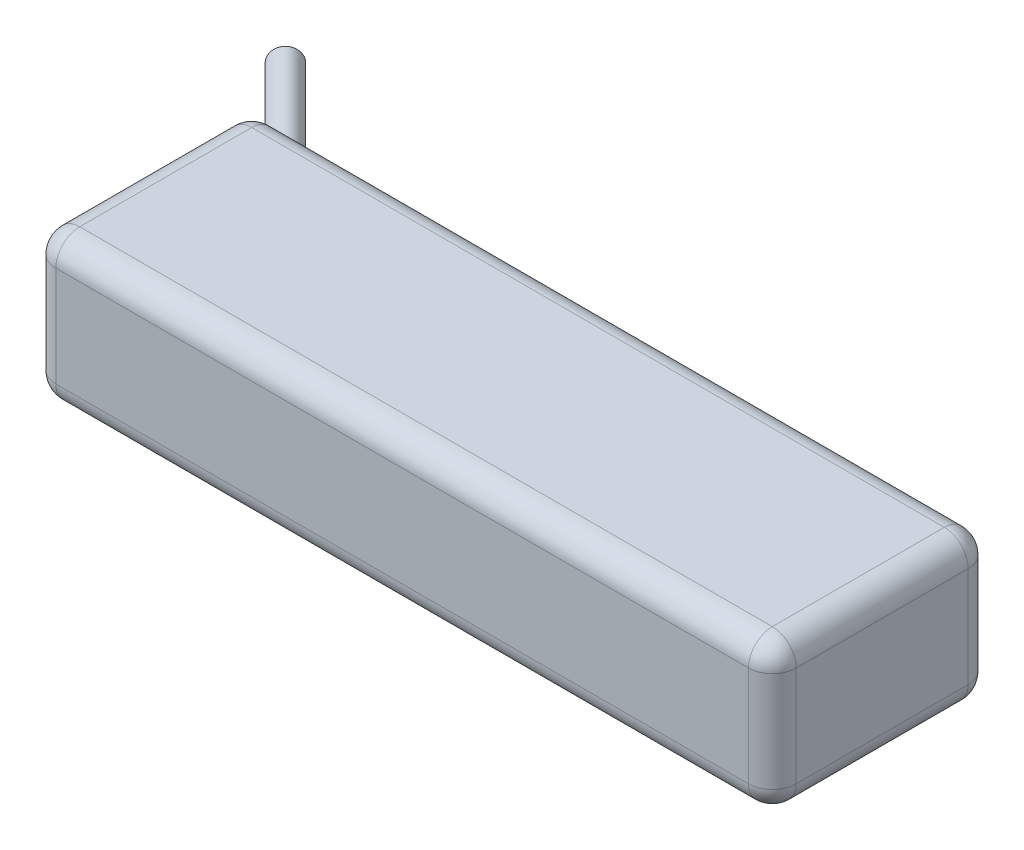
ISO-10303-21;
HEADER;
FILE_DESCRIPTION(('STEP AP214'),'2;1');
FILE_NAME('part.step','',(''),(''),'','','');
FILE_SCHEMA(('AUTOMOTIVE_DESIGN { 1 0 10303 214 1 1 1 1 }'));
ENDSEC;
DATA;
#1=APPLICATION_CONTEXT('core data for automotive mechanical design processes');
#2=APPLICATION_PROTOCOL_DEFINITION('international standard','automotive_design',2000,#1);
#3=PRODUCT_CONTEXT('',#1,'mechanical');
#4=PRODUCT('Part','Part','',(#3));
#5=PRODUCT_RELATED_PRODUCT_CATEGORY('part','',(#4));
#6=PRODUCT_DEFINITION_FORMATION('','',#4);
#7=PRODUCT_DEFINITION_CONTEXT('part definition',#1,'design');
#8=PRODUCT_DEFINITION('design','',#6,#7);
#9=PRODUCT_DEFINITION_SHAPE('','',#8);
#10=(LENGTH_UNIT() NAMED_UNIT(*) SI_UNIT(.MILLI.,.METRE.));
#11=(NAMED_UNIT(*) PLANE_ANGLE_UNIT() SI_UNIT($,.RADIAN.));
#12=(NAMED_UNIT(*) SI_UNIT($,.STERADIAN.) SOLID_ANGLE_UNIT());
#13=UNCERTAINTY_MEASURE_WITH_UNIT(LENGTH_MEASURE(1.E-05),#10,'distance_accuracy_value','');
#14=(GEOMETRIC_REPRESENTATION_CONTEXT(3) GLOBAL_UNCERTAINTY_ASSIGNED_CONTEXT((#13)) GLOBAL_UNIT_ASSIGNED_CONTEXT((#10,
#11,#12)) REPRESENTATION_CONTEXT('',''));
#15=CARTESIAN_POINT('',(0.,0.,0.));
#16=DIRECTION('',(0.,0.,1.));
#17=DIRECTION('',(1.,0.,0.));
#18=AXIS2_PLACEMENT_3D('',#15,#16,#17);
#19=CARTESIAN_POINT('',(77.5,15.5,-23.));
#20=DIRECTION('',(-1.,0.,0.));
#21=DIRECTION('',(0.,0.,1.));
#22=AXIS2_PLACEMENT_3D('',#19,#20,#21);
#23=PLANE('',#22);
#24=DIRECTION('',(0.,-1.,0.));
#25=VECTOR('',#24,1.);
#26=CARTESIAN_POINT('',(77.5,15.5,18.));
#27=LINE('',#26,#25);
#28=CARTESIAN_POINT('',(77.5,10.5,18.));
#29=VERTEX_POINT('',#28);
#30=CARTESIAN_POINT('',(77.5,-10.5,18.));
#31=VERTEX_POINT('',#30);
#32=EDGE_CURVE('E200',#29,#31,#27,.T.);
#33=ORIENTED_EDGE('',*,*,#32,.T.);
#34=DIRECTION('',(0.,0.,-1.));
#35=VECTOR('',#34,1.);
#36=CARTESIAN_POINT('',(77.5,-10.5,-23.));
#37=LINE('',#36,#35);
#38=CARTESIAN_POINT('',(77.5,-10.5,-18.));
#39=VERTEX_POINT('',#38);
#40=EDGE_CURVE('E205',#31,#39,#37,.T.);
#41=ORIENTED_EDGE('',*,*,#40,.T.);
#42=DIRECTION('',(0.,-1.,0.));
#43=VECTOR('',#42,1.);
#44=CARTESIAN_POINT('',(77.5,15.5,-18.));
#45=LINE('',#44,#43);
#46=CARTESIAN_POINT('',(77.5,10.5,-18.));
#47=VERTEX_POINT('',#46);
#48=EDGE_CURVE('E202',#39,#47,#45,.F.);
#49=ORIENTED_EDGE('',*,*,#48,.T.);
#50=DIRECTION('',(0.,0.,-1.));
#51=VECTOR('',#50,1.);
#52=CARTESIAN_POINT('',(77.5,10.5,23.));
#53=LINE('',#52,#51);
#54=EDGE_CURVE('E198',#47,#29,#53,.F.);
#55=ORIENTED_EDGE('',*,*,#54,.T.);
#56=EDGE_LOOP('',(#33,#41,#49,#55));
#57=FACE_BOUND('',#56,.T.);
#58=ADVANCED_FACE('F36',(#57),#23,.F.);
#59=CARTESIAN_POINT('',(-77.5,15.5,-23.));
#60=DIRECTION('',(0.,0.,1.));
#61=DIRECTION('',(1.,0.,0.));
#62=AXIS2_PLACEMENT_3D('',#59,#60,#61);
#63=PLANE('',#62);
#64=CARTESIAN_POINT('',(-70.4289321881345,-6.,-23.));
#65=DIRECTION('',(0.,0.,1.));
#66=DIRECTION('',(1.,0.,0.));
#67=AXIS2_PLACEMENT_3D('',#64,#65,#66);
#68=ELLIPSE('',#67,4.24264068711925,2.99999999999999);
#69=CARTESIAN_POINT('',(-67.4999999999999,-3.82959033391061,-23.));
#70=VERTEX_POINT('',#69);
#71=CARTESIAN_POINT('',(-72.5,-3.38172975815573,-23.));
#72=VERTEX_POINT('',#71);
#73=EDGE_CURVE('E159',#70,#72,#68,.T.);
#74=ORIENTED_EDGE('',*,*,#73,.T.);
#75=DIRECTION('',(0.,-1.,0.));
#76=VECTOR('',#75,1.);
#77=CARTESIAN_POINT('',(-72.5,15.5,-23.));
#78=LINE('',#77,#76);
#79=CARTESIAN_POINT('',(-72.5,3.3817297581557,-23.));
#80=VERTEX_POINT('',#79);
#81=EDGE_CURVE('E196',#72,#80,#78,.F.);
#82=ORIENTED_EDGE('',*,*,#81,.T.);
#83=CARTESIAN_POINT('',(-70.4289321881345,6.,-23.));
#84=DIRECTION('',(0.,0.,1.));
#85=DIRECTION('',(1.,0.,0.));
#86=AXIS2_PLACEMENT_3D('',#83,#84,#85);
#87=ELLIPSE('',#86,4.24264068711927,3.);
#88=CARTESIAN_POINT('',(-67.4999999999999,3.82959033391058,-23.));
#89=VERTEX_POINT('',#88);
#90=EDGE_CURVE('E183',#80,#89,#87,.T.);
#91=ORIENTED_EDGE('',*,*,#90,.T.);
#92=DIRECTION('',(0.,1.,0.));
#93=VECTOR('',#92,1.);
#94=CARTESIAN_POINT('',(-67.4999999999999,15.5,-23.));
#95=LINE('',#94,#93);
#96=CARTESIAN_POINT('',(-67.4999999999999,8.17040966608942,-23.));
#97=VERTEX_POINT('',#96);
#98=EDGE_CURVE('E179',#89,#97,#95,.T.);
#99=ORIENTED_EDGE('',*,*,#98,.T.);
#100=CARTESIAN_POINT('',(-72.5,8.61827024184429,-23.));
#101=VERTEX_POINT('',#100);
#102=EDGE_CURVE('E165',#97,#101,#87,.T.);
#103=ORIENTED_EDGE('',*,*,#102,.T.);
#104=DIRECTION('',(0.,-1.,0.));
#105=VECTOR('',#104,1.);
#106=CARTESIAN_POINT('',(-72.5,15.5,-23.));
#107=LINE('',#106,#105);
#108=CARTESIAN_POINT('',(-72.5,10.5,-23.));
#109=VERTEX_POINT('',#108);
#110=EDGE_CURVE('E188',#101,#109,#107,.F.);
#111=ORIENTED_EDGE('',*,*,#110,.T.);
#112=DIRECTION('',(-1.,0.,0.));
#113=VECTOR('',#112,1.);
#114=CARTESIAN_POINT('',(77.5,10.5,-23.));
#115=LINE('',#114,#113);
#116=CARTESIAN_POINT('',(72.5,10.5,-23.));
#117=VERTEX_POINT('',#116);
#118=EDGE_CURVE('E186',#109,#117,#115,.F.);
#119=ORIENTED_EDGE('',*,*,#118,.T.);
#120=DIRECTION('',(0.,-1.,0.));
#121=VECTOR('',#120,1.);
#122=CARTESIAN_POINT('',(72.5,15.5,-23.));
#123=LINE('',#122,#121);
#124=CARTESIAN_POINT('',(72.5,-10.5,-23.));
#125=VERTEX_POINT('',#124);
#126=EDGE_CURVE('E190',#117,#125,#123,.T.);
#127=ORIENTED_EDGE('',*,*,#126,.T.);
#128=DIRECTION('',(-1.,0.,0.));
#129=VECTOR('',#128,1.);
#130=CARTESIAN_POINT('',(-77.5,-10.5,-23.));
#131=LINE('',#130,#129);
#132=CARTESIAN_POINT('',(-72.5,-10.5,-23.));
#133=VERTEX_POINT('',#132);
#134=EDGE_CURVE('E193',#125,#133,#131,.T.);
#135=ORIENTED_EDGE('',*,*,#134,.T.);
#136=DIRECTION('',(0.,-1.,0.));
#137=VECTOR('',#136,1.);
#138=CARTESIAN_POINT('',(-72.5,15.5,-23.));
#139=LINE('',#138,#137);
#140=CARTESIAN_POINT('',(-72.5,-8.61827024184429,-23.));
#141=VERTEX_POINT('',#140);
#142=EDGE_CURVE('E155',#133,#141,#139,.F.);
#143=ORIENTED_EDGE('',*,*,#142,.T.);
#144=CARTESIAN_POINT('',(-67.4999999999999,-8.1704096660894,-23.));
#145=VERTEX_POINT('',#144);
#146=EDGE_CURVE('E149',#141,#145,#68,.T.);
#147=ORIENTED_EDGE('',*,*,#146,.T.);
#148=DIRECTION('',(0.,1.,0.));
#149=VECTOR('',#148,1.);
#150=CARTESIAN_POINT('',(-67.4999999999999,15.5,-23.));
#151=LINE('',#150,#149);
#152=EDGE_CURVE('E153',#145,#70,#151,.T.);
#153=ORIENTED_EDGE('',*,*,#152,.T.);
#154=EDGE_LOOP('',(#74,#82,#91,#99,#103,#111,#119,#127,#135,#143,#147,#153));
#155=FACE_BOUND('',#154,.T.);
#156=ADVANCED_FACE('F152',(#155),#63,.F.);
#157=CARTESIAN_POINT('',(-77.5,15.5,-23.));
#158=DIRECTION('',(1.,0.,0.));
#159=DIRECTION('',(0.,0.,-1.));
#160=AXIS2_PLACEMENT_3D('',#157,#158,#159);
#161=PLANE('',#160);
#162=DIRECTION('',(0.,-1.,0.));
#163=VECTOR('',#162,1.);
#164=CARTESIAN_POINT('',(-77.5,15.5,-18.));
#165=LINE('',#164,#163);
#166=CARTESIAN_POINT('',(-77.5,10.5,-18.));
#167=VERTEX_POINT('',#166);
#168=CARTESIAN_POINT('',(-77.5,-10.5,-18.));
#169=VERTEX_POINT('',#168);
#170=EDGE_CURVE('E211',#167,#169,#165,.T.);
#171=ORIENTED_EDGE('',*,*,#170,.T.);
#172=DIRECTION('',(0.,0.,1.));
#173=VECTOR('',#172,1.);
#174=CARTESIAN_POINT('',(-77.5,-10.5,-23.));
#175=LINE('',#174,#173);
#176=CARTESIAN_POINT('',(-77.5,-10.5,18.));
#177=VERTEX_POINT('',#176);
#178=EDGE_CURVE('E214',#169,#177,#175,.T.);
#179=ORIENTED_EDGE('',*,*,#178,.T.);
#180=DIRECTION('',(0.,-1.,0.));
#181=VECTOR('',#180,1.);
#182=CARTESIAN_POINT('',(-77.5,15.5,18.));
#183=LINE('',#182,#181);
#184=CARTESIAN_POINT('',(-77.5,10.5,18.));
#185=VERTEX_POINT('',#184);
#186=EDGE_CURVE('E209',#177,#185,#183,.F.);
#187=ORIENTED_EDGE('',*,*,#186,.T.);
#188=DIRECTION('',(0.,0.,1.));
#189=VECTOR('',#188,1.);
#190=CARTESIAN_POINT('',(-77.5,10.5,-23.));
#191=LINE('',#190,#189);
#192=EDGE_CURVE('E207',#185,#167,#191,.F.);
#193=ORIENTED_EDGE('',*,*,#192,.T.);
#194=EDGE_LOOP('',(#171,#179,#187,#193));
#195=FACE_BOUND('',#194,.T.);
#196=ADVANCED_FACE('F284',(#195),#161,.F.);
#197=CARTESIAN_POINT('',(-77.5,15.5,23.));
#198=DIRECTION('',(0.,0.,-1.));
#199=DIRECTION('',(-1.,0.,0.));
#200=AXIS2_PLACEMENT_3D('',#197,#198,#199);
#201=PLANE('',#200);
#202=DIRECTION('',(0.,-1.,0.));
#203=VECTOR('',#202,1.);
#204=CARTESIAN_POINT('',(-72.5,15.5,23.));
#205=LINE('',#204,#203);
#206=CARTESIAN_POINT('',(-72.5,10.5,23.));
#207=VERTEX_POINT('',#206);
#208=CARTESIAN_POINT('',(-72.5,-10.5,23.));
#209=VERTEX_POINT('',#208);
#210=EDGE_CURVE('E220',#207,#209,#205,.T.);
#211=ORIENTED_EDGE('',*,*,#210,.T.);
#212=DIRECTION('',(1.,0.,0.));
#213=VECTOR('',#212,1.);
#214=CARTESIAN_POINT('',(-77.5,-10.5,23.));
#215=LINE('',#214,#213);
#216=CARTESIAN_POINT('',(72.5,-10.5,23.));
#217=VERTEX_POINT('',#216);
#218=EDGE_CURVE('E223',#209,#217,#215,.T.);
#219=ORIENTED_EDGE('',*,*,#218,.T.);
#220=DIRECTION('',(0.,-1.,0.));
#221=VECTOR('',#220,1.);
#222=CARTESIAN_POINT('',(72.5,15.5,23.));
#223=LINE('',#222,#221);
#224=CARTESIAN_POINT('',(72.5,10.5,23.));
#225=VERTEX_POINT('',#224);
#226=EDGE_CURVE('E218',#217,#225,#223,.F.);
#227=ORIENTED_EDGE('',*,*,#226,.T.);
#228=DIRECTION('',(1.,0.,0.));
#229=VECTOR('',#228,1.);
#230=CARTESIAN_POINT('',(-77.5,10.5,23.));
#231=LINE('',#230,#229);
#232=EDGE_CURVE('E216',#225,#207,#231,.F.);
#233=ORIENTED_EDGE('',*,*,#232,.T.);
#234=EDGE_LOOP('',(#211,#219,#227,#233));
#235=FACE_BOUND('',#234,.T.);
#236=ADVANCED_FACE('F278',(#235),#201,.F.);
#237=CARTESIAN_POINT('',(0.,15.5,0.));
#238=DIRECTION('',(0.,1.,0.));
#239=DIRECTION('',(0.,0.,1.));
#240=AXIS2_PLACEMENT_3D('',#237,#238,#239);
#241=PLANE('',#240);
#242=DIRECTION('',(0.,0.,1.));
#243=VECTOR('',#242,1.);
#244=CARTESIAN_POINT('',(-72.5,15.5,23.));
#245=LINE('',#244,#243);
#246=CARTESIAN_POINT('',(-72.5,15.5,-18.));
#247=VERTEX_POINT('',#246);
#248=CARTESIAN_POINT('',(-72.5,15.5,18.));
#249=VERTEX_POINT('',#248);
#250=EDGE_CURVE('E53',#247,#249,#245,.T.);
#251=ORIENTED_EDGE('',*,*,#250,.T.);
#252=DIRECTION('',(1.,0.,0.));
#253=VECTOR('',#252,1.);
#254=CARTESIAN_POINT('',(77.5,15.5,18.));
#255=LINE('',#254,#253);
#256=CARTESIAN_POINT('',(72.5,15.5,18.));
#257=VERTEX_POINT('',#256);
#258=EDGE_CURVE('E238',#249,#257,#255,.T.);
#259=ORIENTED_EDGE('',*,*,#258,.T.);
#260=DIRECTION('',(0.,0.,-1.));
#261=VECTOR('',#260,1.);
#262=CARTESIAN_POINT('',(72.5,15.5,-23.));
#263=LINE('',#262,#261);
#264=CARTESIAN_POINT('',(72.5,15.5,-18.));
#265=VERTEX_POINT('',#264);
#266=EDGE_CURVE('E234',#257,#265,#263,.T.);
#267=ORIENTED_EDGE('',*,*,#266,.T.);
#268=DIRECTION('',(-1.,0.,0.));
#269=VECTOR('',#268,1.);
#270=CARTESIAN_POINT('',(-77.5,15.5,-18.));
#271=LINE('',#270,#269);
#272=EDGE_CURVE('E58',#265,#247,#271,.T.);
#273=ORIENTED_EDGE('',*,*,#272,.T.);
#274=EDGE_LOOP('',(#251,#259,#267,#273));
#275=FACE_BOUND('',#274,.T.);
#276=ADVANCED_FACE('F275',(#275),#241,.T.);
#277=CARTESIAN_POINT('',(0.,-15.5,0.));
#278=DIRECTION('',(0.,1.,0.));
#279=DIRECTION('',(0.,0.,1.));
#280=AXIS2_PLACEMENT_3D('',#277,#278,#279);
#281=PLANE('',#280);
#282=DIRECTION('',(0.,0.,1.));
#283=VECTOR('',#282,1.);
#284=CARTESIAN_POINT('',(-72.5,-15.5,0.));
#285=LINE('',#284,#283);
#286=CARTESIAN_POINT('',(-72.5,-15.5,18.));
#287=VERTEX_POINT('',#286);
#288=CARTESIAN_POINT('',(-72.5,-15.5,-18.));
#289=VERTEX_POINT('',#288);
#290=EDGE_CURVE('E229',#287,#289,#285,.F.);
#291=ORIENTED_EDGE('',*,*,#290,.T.);
#292=DIRECTION('',(-1.,0.,0.));
#293=VECTOR('',#292,1.);
#294=CARTESIAN_POINT('',(0.,-15.5,-18.));
#295=LINE('',#294,#293);
#296=CARTESIAN_POINT('',(72.5,-15.5,-18.));
#297=VERTEX_POINT('',#296);
#298=EDGE_CURVE('E231',#289,#297,#295,.F.);
#299=ORIENTED_EDGE('',*,*,#298,.T.);
#300=DIRECTION('',(0.,0.,-1.));
#301=VECTOR('',#300,1.);
#302=CARTESIAN_POINT('',(72.5,-15.5,0.));
#303=LINE('',#302,#301);
#304=CARTESIAN_POINT('',(72.5,-15.5,18.));
#305=VERTEX_POINT('',#304);
#306=EDGE_CURVE('E225',#297,#305,#303,.F.);
#307=ORIENTED_EDGE('',*,*,#306,.T.);
#308=DIRECTION('',(1.,0.,0.));
#309=VECTOR('',#308,1.);
#310=CARTESIAN_POINT('',(0.,-15.5,18.));
#311=LINE('',#310,#309);
#312=EDGE_CURVE('E227',#305,#287,#311,.F.);
#313=ORIENTED_EDGE('',*,*,#312,.T.);
#314=EDGE_LOOP('',(#291,#299,#307,#313));
#315=FACE_BOUND('',#314,.T.);
#316=ADVANCED_FACE('F273',(#315),#281,.F.);
#317=CARTESIAN_POINT('',(-90.1776695296636,6.,-42.7487373415292));
#318=DIRECTION('',(0.707106781186544,0.,0.707106781186551));
#319=DIRECTION('',(0.707106781186551,0.,-0.707106781186544));
#320=AXIS2_PLACEMENT_3D('',#317,#318,#319);
#321=CYLINDRICAL_SURFACE('',#320,3.);
#322=CARTESIAN_POINT('',(-90.1776695296636,6.,-42.7487373415292));
#323=DIRECTION('',(0.707106781186544,0.,0.707106781186551));
#324=DIRECTION('',(0.707106781186551,0.,-0.707106781186544));
#325=AXIS2_PLACEMENT_3D('',#322,#323,#324);
#326=CIRCLE('',#325,3.);
#327=CARTESIAN_POINT('',(-88.0563491861039,6.,-44.8700576850888));
#328=VERTEX_POINT('',#327);
#329=EDGE_CURVE('E176',#328,#328,#326,.T.);
#330=ORIENTED_EDGE('',*,*,#329,.T.);
#331=EDGE_LOOP('',(#330));
#332=FACE_BOUND('',#331,.T.);
#333=ORIENTED_EDGE('',*,*,#102,.F.);
#334=CARTESIAN_POINT('',(-68.9644660940672,6.,-21.5355339059327));
#335=DIRECTION('',(0.707106781186544,0.,0.707106781186551));
#336=DIRECTION('',(0.707106781186551,0.,-0.707106781186544));
#337=AXIS2_PLACEMENT_3D('',#334,#335,#336);
#338=CIRCLE('',#337,3.);
#339=EDGE_CURVE('E171',#89,#97,#338,.T.);
#340=ORIENTED_EDGE('',*,*,#339,.F.);
#341=ORIENTED_EDGE('',*,*,#90,.F.);
#342=CARTESIAN_POINT('',(-72.5,3.3817297581557,-23.));
#343=CARTESIAN_POINT('',(-72.5742723367273,3.41108832496102,-23.0000159399462));
#344=CARTESIAN_POINT('',(-72.6476207025028,3.44284189234237,-22.9983455721439));
#345=CARTESIAN_POINT('',(-72.7918514548512,3.51135555776492,-22.9919929695657));
#346=CARTESIAN_POINT('',(-72.8627324692063,3.54811838757358,-22.987309086166));
#347=CARTESIAN_POINT('',(-73.0013738349952,3.62686159193329,-22.9752869767334));
#348=CARTESIAN_POINT('',(-73.0691320776828,3.66884542336693,-22.9679469858548));
#349=CARTESIAN_POINT('',(-73.2008044407651,3.7580513502681,-22.9510883121884));
#350=CARTESIAN_POINT('',(-73.2647194086501,3.80527228430799,-22.9415701119641));
#351=CARTESIAN_POINT('',(-73.3883498792829,3.90508416188707,-22.9208515990757));
#352=CARTESIAN_POINT('',(-73.4480477003386,3.95769568272804,-22.9096447576015));
#353=CARTESIAN_POINT('',(-73.5624289240457,4.06794124194849,-22.8861698458924));
#354=CARTESIAN_POINT('',(-73.6171104014602,4.12557719225443,-22.8739013716917));
#355=CARTESIAN_POINT('',(-73.720877648095,4.24542484669456,-22.8489486158682));
#356=CARTESIAN_POINT('',(-73.7699731825568,4.30762824272717,-22.8362651113942));
#357=CARTESIAN_POINT('',(-73.8623256924469,4.43626971139602,-22.8110662623183));
#358=CARTESIAN_POINT('',(-73.9055805192486,4.50270932925477,-22.7985509811173));
#359=CARTESIAN_POINT('',(-74.0216641364888,4.70003719530852,-22.7634914472142));
#360=CARTESIAN_POINT('',(-74.0866844429277,4.83580851525652,-22.7419004637254));
#361=CARTESIAN_POINT('',(-74.1938158361093,5.11688746130414,-22.7047030515143));
#362=CARTESIAN_POINT('',(-74.2359108140236,5.26220171275287,-22.6891008331548));
#363=CARTESIAN_POINT('',(-74.2969896532276,5.55896345294547,-22.6660375615635));
#364=CARTESIAN_POINT('',(-74.315863433376,5.71043666512147,-22.6586153029766));
#365=CARTESIAN_POINT('',(-74.3300464396259,6.01461913202763,-22.6530623769069));
#366=CARTESIAN_POINT('',(-74.3253590100612,6.1673282082643,-22.6549303907405));
#367=CARTESIAN_POINT('',(-74.2922105447137,6.47195434588734,-22.6677940262898));
#368=CARTESIAN_POINT('',(-74.2634148923934,6.62382980628909,-22.6789181066376));
#369=CARTESIAN_POINT('',(-74.1817621463717,6.92018488185417,-22.7088801014918));
#370=CARTESIAN_POINT('',(-74.1289053741197,7.06466459579382,-22.7277179129446));
#371=CARTESIAN_POINT('',(-74.0001936008059,7.3409699630706,-22.7701102706688));
#372=CARTESIAN_POINT('',(-73.9245059269818,7.47287879044457,-22.793630089844));
#373=CARTESIAN_POINT('',(-73.7514983668244,7.72139788663652,-22.8416696485936));
#374=CARTESIAN_POINT('',(-73.6541856386271,7.83801319751599,-22.8661890551055));
#375=CARTESIAN_POINT('',(-73.4423809961509,8.051467207762,-22.9115618130799));
#376=CARTESIAN_POINT('',(-73.3281831635034,8.14858795941213,-22.9324667324496));
#377=CARTESIAN_POINT('',(-73.0852699031232,8.32409759288815,-22.9671368182234));
#378=CARTESIAN_POINT('',(-72.9565582829987,8.40249137087535,-22.9809038519294));
#379=CARTESIAN_POINT('',(-72.7704268742803,8.49890371404055,-22.9929620481587));
#380=CARTESIAN_POINT('',(-72.717138368038,8.52469339430982,-22.9955748798162));
#381=CARTESIAN_POINT('',(-72.6094069619065,8.57350232254528,-22.9990921077681));
#382=CARTESIAN_POINT('',(-72.5549671777073,8.59652814260913,-23.0000006351527));
#383=CARTESIAN_POINT('',(-72.5,8.61827024184429,-23.));
#384=B_SPLINE_CURVE_WITH_KNOTS('',3,(#342,#343,#344,#345,#346,#347,#348,#349,#350,#351,#352,
#353,#354,#355,#356,#357,#358,#359,#360,#361,#362,#363,#364,#365,#366,#367,#368,#369,#370,#371,
#372,#373,#374,#375,#376,#377,#378,#379,#380,#381,#382,#383),.UNSPECIFIED.,.F.,.F.,(4,2,2,2,2,2,
2,2,2,2,2,2,2,2,2,2,2,2,2,2,4),(0.,0.239566378314003,0.479263929350949,0.719121040311207,
0.958925064336937,1.19968123556778,1.44052942407659,1.68094987784811,1.92145853575557,
2.37534443151219,2.82954884690596,3.2858982444013,3.74218286841549,4.20490767925687,
4.66762630841185,5.12703284251332,5.58628753380606,6.03832326189554,6.49024067572018,
6.66794128742332,6.845210608445),.UNSPECIFIED.);
#385=EDGE_CURVE('E11',#80,#101,#384,.T.);
#386=ORIENTED_EDGE('',*,*,#385,.T.);
#387=EDGE_LOOP('',(#333,#340,#341,#386));
#388=FACE_BOUND('',#387,.T.);
#389=ADVANCED_FACE('F268',(#332,#388),#321,.T.);
#390=CARTESIAN_POINT('',(-68.9644660940672,6.,-21.5355339059327));
#391=DIRECTION('',(0.707106781186544,0.,0.707106781186551));
#392=DIRECTION('',(0.707106781186551,0.,-0.707106781186544));
#393=AXIS2_PLACEMENT_3D('',#390,#391,#392);
#394=PLANE('',#393);
#395=ORIENTED_EDGE('',*,*,#98,.F.);
#396=ORIENTED_EDGE('',*,*,#339,.T.);
#397=EDGE_LOOP('',(#395,#396));
#398=FACE_BOUND('',#397,.T.);
#399=ADVANCED_FACE('F265',(#398),#394,.T.);
#400=CARTESIAN_POINT('',(-90.1776695296636,6.,-42.7487373415292));
#401=DIRECTION('',(0.707106781186544,0.,0.707106781186551));
#402=DIRECTION('',(0.707106781186551,0.,-0.707106781186544));
#403=AXIS2_PLACEMENT_3D('',#400,#401,#402);
#404=PLANE('',#403);
#405=ORIENTED_EDGE('',*,*,#329,.F.);
#406=EDGE_LOOP('',(#405));
#407=FACE_BOUND('',#406,.T.);
#408=ADVANCED_FACE('F260',(#407),#404,.F.);
#409=CARTESIAN_POINT('',(-90.1776695296636,-6.,-42.7487373415292));
#410=DIRECTION('',(0.707106781186544,0.,0.707106781186551));
#411=DIRECTION('',(0.707106781186551,0.,-0.707106781186544));
#412=AXIS2_PLACEMENT_3D('',#409,#410,#411);
#413=CYLINDRICAL_SURFACE('',#412,2.99999999999999);
#414=CARTESIAN_POINT('',(-90.1776695296636,-6.,-42.7487373415292));
#415=DIRECTION('',(0.707106781186544,0.,0.707106781186551));
#416=DIRECTION('',(0.707106781186551,0.,-0.707106781186544));
#417=AXIS2_PLACEMENT_3D('',#414,#415,#416);
#418=CIRCLE('',#417,2.99999999999999);
#419=CARTESIAN_POINT('',(-88.0563491861039,-6.,-44.8700576850888));
#420=VERTEX_POINT('',#419);
#421=EDGE_CURVE('E168',#420,#420,#418,.T.);
#422=ORIENTED_EDGE('',*,*,#421,.T.);
#423=EDGE_LOOP('',(#422));
#424=FACE_BOUND('',#423,.T.);
#425=ORIENTED_EDGE('',*,*,#73,.F.);
#426=CARTESIAN_POINT('',(-68.9644660940672,-6.,-21.5355339059327));
#427=DIRECTION('',(0.707106781186544,0.,0.707106781186551));
#428=DIRECTION('',(0.707106781186551,0.,-0.707106781186544));
#429=AXIS2_PLACEMENT_3D('',#426,#427,#428);
#430=CIRCLE('',#429,2.99999999999999);
#431=EDGE_CURVE('E163',#145,#70,#430,.T.);
#432=ORIENTED_EDGE('',*,*,#431,.F.);
#433=ORIENTED_EDGE('',*,*,#146,.F.);
#434=CARTESIAN_POINT('',(-72.5,-8.61827024184429,-23.));
#435=CARTESIAN_POINT('',(-72.5742723367273,-8.58891167503896,-23.0000159399462));
#436=CARTESIAN_POINT('',(-72.6476207025028,-8.55715810765762,-22.9983455721439));
#437=CARTESIAN_POINT('',(-72.7918514548512,-8.48864444223507,-22.9919929695657));
#438=CARTESIAN_POINT('',(-72.8627324692063,-8.45188161242641,-22.987309086166));
#439=CARTESIAN_POINT('',(-73.0013738349952,-8.3731384080667,-22.9752869767334));
#440=CARTESIAN_POINT('',(-73.0691320776828,-8.33115457663306,-22.9679469858548));
#441=CARTESIAN_POINT('',(-73.2008044407651,-8.24194864973189,-22.9510883121884));
#442=CARTESIAN_POINT('',(-73.2647194086501,-8.194727715692,-22.9415701119641));
#443=CARTESIAN_POINT('',(-73.3883498792829,-8.09491583811292,-22.9208515990757));
#444=CARTESIAN_POINT('',(-73.4480477003386,-8.04230431727195,-22.9096447576015));
#445=CARTESIAN_POINT('',(-73.5624289240457,-7.9320587580515,-22.8861698458924));
#446=CARTESIAN_POINT('',(-73.6171104014602,-7.87442280774556,-22.8739013716917));
#447=CARTESIAN_POINT('',(-73.720877648095,-7.75457515330543,-22.8489486158683));
#448=CARTESIAN_POINT('',(-73.7699731825568,-7.69237175727282,-22.8362651113942));
#449=CARTESIAN_POINT('',(-73.8623256924469,-7.56373028860398,-22.8110662623184));
#450=CARTESIAN_POINT('',(-73.9055805192486,-7.49729067074523,-22.7985509811173));
#451=CARTESIAN_POINT('',(-74.0216641364887,-7.29996280469149,-22.7634914472142));
#452=CARTESIAN_POINT('',(-74.0866844429276,-7.16419148474348,-22.7419004637254));
#453=CARTESIAN_POINT('',(-74.1938158361093,-6.88311253869587,-22.7047030515143));
#454=CARTESIAN_POINT('',(-74.2359108140236,-6.73779828724713,-22.6891008331548));
#455=CARTESIAN_POINT('',(-74.2969896532276,-6.44103654705453,-22.6660375615635));
#456=CARTESIAN_POINT('',(-74.3158634333759,-6.28956333487853,-22.6586153029766));
#457=CARTESIAN_POINT('',(-74.3300464396259,-5.98538086797238,-22.6530623769069));
#458=CARTESIAN_POINT('',(-74.3253590100612,-5.83267179173571,-22.6549303907405));
#459=CARTESIAN_POINT('',(-74.2922105447137,-5.52804565411267,-22.6677940262898));
#460=CARTESIAN_POINT('',(-74.2634148923934,-5.37617019371093,-22.6789181066376));
#461=CARTESIAN_POINT('',(-74.1817621463716,-5.07981511814585,-22.7088801014918));
#462=CARTESIAN_POINT('',(-74.1289053741197,-4.93533540420619,-22.7277179129446));
#463=CARTESIAN_POINT('',(-74.0001936008059,-4.65903003692942,-22.7701102706688));
#464=CARTESIAN_POINT('',(-73.9245059269818,-4.52712120955546,-22.793630089844));
#465=CARTESIAN_POINT('',(-73.7514983668244,-4.2786021133635,-22.8416696485936));
#466=CARTESIAN_POINT('',(-73.6541856386271,-4.16198680248403,-22.8661890551055));
#467=CARTESIAN_POINT('',(-73.4423809961509,-3.94853279223802,-22.9115618130799));
#468=CARTESIAN_POINT('',(-73.3281831635034,-3.85141204058789,-22.9324667324496));
#469=CARTESIAN_POINT('',(-73.0852699031232,-3.67590240711187,-22.9671368182234));
#470=CARTESIAN_POINT('',(-72.9565582829987,-3.59750862912467,-22.9809038519294));
#471=CARTESIAN_POINT('',(-72.7704268742803,-3.50109628595947,-22.9929620481587));
#472=CARTESIAN_POINT('',(-72.717138368038,-3.4753066056902,-22.9955748798162));
#473=CARTESIAN_POINT('',(-72.6094069619065,-3.42649767745473,-22.9990921077681));
#474=CARTESIAN_POINT('',(-72.5549671777073,-3.40347185739088,-23.0000006351527));
#475=CARTESIAN_POINT('',(-72.5,-3.38172975815572,-23.));
#476=B_SPLINE_CURVE_WITH_KNOTS('',3,(#434,#435,#436,#437,#438,#439,#440,#441,#442,#443,#444,
#445,#446,#447,#448,#449,#450,#451,#452,#453,#454,#455,#456,#457,#458,#459,#460,#461,#462,#463,
#464,#465,#466,#467,#468,#469,#470,#471,#472,#473,#474,#475),.UNSPECIFIED.,.F.,.F.,(4,2,2,2,2,2,
2,2,2,2,2,2,2,2,2,2,2,2,2,2,4),(0.,0.239566378313987,0.479263929350932,0.719121040311205,
0.95892506433692,1.19968123556776,1.44052942407658,1.68094987784807,1.92145853575554,
2.37534443151216,2.82954884690594,3.28589824440127,3.74218286841545,4.20490767925682,
4.66762630841181,5.12703284251326,5.58628753380601,6.03832326189549,6.49024067572013,
6.66794128742327,6.84521060844495),.UNSPECIFIED.);
#477=EDGE_CURVE('E45',#141,#72,#476,.T.);
#478=ORIENTED_EDGE('',*,*,#477,.T.);
#479=EDGE_LOOP('',(#425,#432,#433,#478));
#480=FACE_BOUND('',#479,.T.);
#481=ADVANCED_FACE('F167',(#424,#480),#413,.T.);
#482=CARTESIAN_POINT('',(-68.9644660940672,-6.,-21.5355339059327));
#483=DIRECTION('',(0.707106781186544,0.,0.707106781186551));
#484=DIRECTION('',(0.707106781186551,0.,-0.707106781186544));
#485=AXIS2_PLACEMENT_3D('',#482,#483,#484);
#486=PLANE('',#485);
#487=ORIENTED_EDGE('',*,*,#152,.F.);
#488=ORIENTED_EDGE('',*,*,#431,.T.);
#489=EDGE_LOOP('',(#487,#488));
#490=FACE_BOUND('',#489,.T.);
#491=ADVANCED_FACE('F162',(#490),#486,.T.);
#492=CARTESIAN_POINT('',(-90.1776695296636,-6.,-42.7487373415292));
#493=DIRECTION('',(0.707106781186544,0.,0.707106781186551));
#494=DIRECTION('',(0.707106781186551,0.,-0.707106781186544));
#495=AXIS2_PLACEMENT_3D('',#492,#493,#494);
#496=PLANE('',#495);
#497=ORIENTED_EDGE('',*,*,#421,.F.);
#498=EDGE_LOOP('',(#497));
#499=FACE_BOUND('',#498,.T.);
#500=ADVANCED_FACE('F479',(#499),#496,.F.);
#501=CARTESIAN_POINT('',(-72.5,15.5,18.));
#502=DIRECTION('',(0.,-1.,0.));
#503=DIRECTION('',(0.,0.,-1.));
#504=AXIS2_PLACEMENT_3D('',#501,#502,#503);
#505=CYLINDRICAL_SURFACE('',#504,5.);
#506=CARTESIAN_POINT('',(-72.5,10.5,18.));
#507=DIRECTION('',(0.,1.,0.));
#508=DIRECTION('',(0.,0.,1.));
#509=AXIS2_PLACEMENT_3D('',#506,#507,#508);
#510=CIRCLE('',#509,5.);
#511=EDGE_CURVE('E40',#185,#207,#510,.T.);
#512=ORIENTED_EDGE('',*,*,#511,.F.);
#513=ORIENTED_EDGE('',*,*,#186,.F.);
#514=CARTESIAN_POINT('',(-72.5,-10.5,18.));
#515=DIRECTION('',(0.,-1.,0.));
#516=DIRECTION('',(0.,0.,-1.));
#517=AXIS2_PLACEMENT_3D('',#514,#515,#516);
#518=CIRCLE('',#517,5.);
#519=EDGE_CURVE('E174',#209,#177,#518,.T.);
#520=ORIENTED_EDGE('',*,*,#519,.F.);
#521=ORIENTED_EDGE('',*,*,#210,.F.);
#522=EDGE_LOOP('',(#512,#513,#520,#521));
#523=FACE_BOUND('',#522,.T.);
#524=ADVANCED_FACE('F38',(#523),#505,.T.);
#525=CARTESIAN_POINT('',(-72.5,10.5,18.));
#526=DIRECTION('',(0.,0.,1.));
#527=DIRECTION('',(1.,0.,0.));
#528=AXIS2_PLACEMENT_3D('',#525,#526,#527);
#529=SPHERICAL_SURFACE('',#528,5.);
#530=CARTESIAN_POINT('',(-72.5,10.5,18.));
#531=DIRECTION('',(0.,0.,1.));
#532=DIRECTION('',(1.,0.,0.));
#533=AXIS2_PLACEMENT_3D('',#530,#531,#532);
#534=CIRCLE('',#533,5.);
#535=EDGE_CURVE('E362',#185,#249,#534,.F.);
#536=ORIENTED_EDGE('',*,*,#535,.F.);
#537=ORIENTED_EDGE('',*,*,#511,.T.);
#538=CARTESIAN_POINT('',(-72.5,10.5,18.));
#539=DIRECTION('',(-1.,0.,0.));
#540=DIRECTION('',(0.,0.,1.));
#541=AXIS2_PLACEMENT_3D('',#538,#539,#540);
#542=CIRCLE('',#541,5.);
#543=EDGE_CURVE('E365',#249,#207,#542,.F.);
#544=ORIENTED_EDGE('',*,*,#543,.F.);
#545=EDGE_LOOP('',(#536,#537,#544));
#546=FACE_BOUND('',#545,.T.);
#547=ADVANCED_FACE('F472',(#546),#529,.T.);
#548=CARTESIAN_POINT('',(-72.5,-10.5,18.));
#549=DIRECTION('',(-1.,0.,0.));
#550=DIRECTION('',(0.,0.,1.));
#551=AXIS2_PLACEMENT_3D('',#548,#549,#550);
#552=SPHERICAL_SURFACE('',#551,5.);
#553=CARTESIAN_POINT('',(-72.5,-10.5,18.));
#554=DIRECTION('',(-1.,0.,0.));
#555=DIRECTION('',(0.,0.,1.));
#556=AXIS2_PLACEMENT_3D('',#553,#554,#555);
#557=CIRCLE('',#556,5.);
#558=EDGE_CURVE('E363',#209,#287,#557,.F.);
#559=ORIENTED_EDGE('',*,*,#558,.F.);
#560=ORIENTED_EDGE('',*,*,#519,.T.);
#561=CARTESIAN_POINT('',(-72.5,-10.5,18.));
#562=DIRECTION('',(0.,0.,1.));
#563=DIRECTION('',(1.,0.,0.));
#564=AXIS2_PLACEMENT_3D('',#561,#562,#563);
#565=CIRCLE('',#564,5.);
#566=EDGE_CURVE('E357',#287,#177,#565,.F.);
#567=ORIENTED_EDGE('',*,*,#566,.F.);
#568=EDGE_LOOP('',(#559,#560,#567));
#569=FACE_BOUND('',#568,.T.);
#570=ADVANCED_FACE('F374',(#569),#552,.T.);
#571=CARTESIAN_POINT('',(0.,10.5,18.));
#572=DIRECTION('',(-1.,0.,0.));
#573=DIRECTION('',(0.,0.,1.));
#574=AXIS2_PLACEMENT_3D('',#571,#572,#573);
#575=CYLINDRICAL_SURFACE('',#574,5.);
#576=ORIENTED_EDGE('',*,*,#543,.T.);
#577=ORIENTED_EDGE('',*,*,#232,.F.);
#578=CARTESIAN_POINT('',(72.5,10.5,18.));
#579=DIRECTION('',(1.,0.,0.));
#580=DIRECTION('',(0.,0.,-1.));
#581=AXIS2_PLACEMENT_3D('',#578,#579,#580);
#582=CIRCLE('',#581,5.);
#583=EDGE_CURVE('E387',#257,#225,#582,.T.);
#584=ORIENTED_EDGE('',*,*,#583,.F.);
#585=ORIENTED_EDGE('',*,*,#258,.F.);
#586=EDGE_LOOP('',(#576,#577,#584,#585));
#587=FACE_BOUND('',#586,.T.);
#588=ADVANCED_FACE('F384',(#587),#575,.T.);
#589=CARTESIAN_POINT('',(-72.5,10.5,0.));
#590=DIRECTION('',(0.,0.,-1.));
#591=DIRECTION('',(-1.,0.,0.));
#592=AXIS2_PLACEMENT_3D('',#589,#590,#591);
#593=CYLINDRICAL_SURFACE('',#592,5.);
#594=ORIENTED_EDGE('',*,*,#535,.T.);
#595=ORIENTED_EDGE('',*,*,#250,.F.);
#596=CARTESIAN_POINT('',(-72.5,10.5,-18.));
#597=DIRECTION('',(0.,0.,-1.));
#598=DIRECTION('',(-1.,0.,0.));
#599=AXIS2_PLACEMENT_3D('',#596,#597,#598);
#600=CIRCLE('',#599,5.);
#601=EDGE_CURVE('E396',#167,#247,#600,.T.);
#602=ORIENTED_EDGE('',*,*,#601,.F.);
#603=ORIENTED_EDGE('',*,*,#192,.F.);
#604=EDGE_LOOP('',(#594,#595,#602,#603));
#605=FACE_BOUND('',#604,.T.);
#606=ADVANCED_FACE('F351',(#605),#593,.T.);
#607=CARTESIAN_POINT('',(-72.5,15.5,-18.));
#608=DIRECTION('',(0.,-1.,0.));
#609=DIRECTION('',(0.,0.,-1.));
#610=AXIS2_PLACEMENT_3D('',#607,#608,#609);
#611=CYLINDRICAL_SURFACE('',#610,5.);
#612=CARTESIAN_POINT('',(-72.5,-10.5,-18.));
#613=DIRECTION('',(0.,-1.,0.));
#614=DIRECTION('',(0.,0.,-1.));
#615=AXIS2_PLACEMENT_3D('',#612,#613,#614);
#616=CIRCLE('',#615,5.);
#617=EDGE_CURVE('E404',#169,#133,#616,.T.);
#618=ORIENTED_EDGE('',*,*,#617,.F.);
#619=ORIENTED_EDGE('',*,*,#170,.F.);
#620=CARTESIAN_POINT('',(-72.5,10.5,-18.));
#621=DIRECTION('',(0.,1.,0.));
#622=DIRECTION('',(0.,0.,1.));
#623=AXIS2_PLACEMENT_3D('',#620,#621,#622);
#624=CIRCLE('',#623,5.);
#625=EDGE_CURVE('E399',#109,#167,#624,.T.);
#626=ORIENTED_EDGE('',*,*,#625,.F.);
#627=ORIENTED_EDGE('',*,*,#110,.F.);
#628=ORIENTED_EDGE('',*,*,#385,.F.);
#629=ORIENTED_EDGE('',*,*,#81,.F.);
#630=ORIENTED_EDGE('',*,*,#477,.F.);
#631=ORIENTED_EDGE('',*,*,#142,.F.);
#632=EDGE_LOOP('',(#618,#619,#626,#627,#628,#629,#630,#631));
#633=FACE_BOUND('',#632,.T.);
#634=ADVANCED_FACE('F252',(#633),#611,.T.);
#635=CARTESIAN_POINT('',(-72.5,-10.5,-23.));
#636=DIRECTION('',(0.,0.,1.));
#637=DIRECTION('',(1.,0.,0.));
#638=AXIS2_PLACEMENT_3D('',#635,#636,#637);
#639=CYLINDRICAL_SURFACE('',#638,5.);
#640=ORIENTED_EDGE('',*,*,#566,.T.);
#641=ORIENTED_EDGE('',*,*,#178,.F.);
#642=CARTESIAN_POINT('',(-72.5,-10.5,-18.));
#643=DIRECTION('',(0.,0.,-1.));
#644=DIRECTION('',(-1.,0.,0.));
#645=AXIS2_PLACEMENT_3D('',#642,#643,#644);
#646=CIRCLE('',#645,5.);
#647=EDGE_CURVE('E407',#289,#169,#646,.T.);
#648=ORIENTED_EDGE('',*,*,#647,.F.);
#649=ORIENTED_EDGE('',*,*,#290,.F.);
#650=EDGE_LOOP('',(#640,#641,#648,#649));
#651=FACE_BOUND('',#650,.T.);
#652=ADVANCED_FACE('F344',(#651),#639,.T.);
#653=CARTESIAN_POINT('',(-77.5,-10.5,18.));
#654=DIRECTION('',(1.,0.,0.));
#655=DIRECTION('',(0.,0.,-1.));
#656=AXIS2_PLACEMENT_3D('',#653,#654,#655);
#657=CYLINDRICAL_SURFACE('',#656,5.);
#658=ORIENTED_EDGE('',*,*,#558,.T.);
#659=ORIENTED_EDGE('',*,*,#312,.F.);
#660=CARTESIAN_POINT('',(72.5,-10.5,18.));
#661=DIRECTION('',(1.,0.,0.));
#662=DIRECTION('',(0.,0.,-1.));
#663=AXIS2_PLACEMENT_3D('',#660,#661,#662);
#664=CIRCLE('',#663,5.);
#665=EDGE_CURVE('E409',#217,#305,#664,.T.);
#666=ORIENTED_EDGE('',*,*,#665,.F.);
#667=ORIENTED_EDGE('',*,*,#218,.F.);
#668=EDGE_LOOP('',(#658,#659,#666,#667));
#669=FACE_BOUND('',#668,.T.);
#670=ADVANCED_FACE('F341',(#669),#657,.T.);
#671=CARTESIAN_POINT('',(72.5,15.5,18.));
#672=DIRECTION('',(0.,-1.,0.));
#673=DIRECTION('',(0.,0.,-1.));
#674=AXIS2_PLACEMENT_3D('',#671,#672,#673);
#675=CYLINDRICAL_SURFACE('',#674,5.);
#676=CARTESIAN_POINT('',(72.5,10.5,18.));
#677=DIRECTION('',(0.,1.,0.));
#678=DIRECTION('',(0.,0.,1.));
#679=AXIS2_PLACEMENT_3D('',#676,#677,#678);
#680=CIRCLE('',#679,5.);
#681=EDGE_CURVE('E368',#225,#29,#680,.T.);
#682=ORIENTED_EDGE('',*,*,#681,.F.);
#683=ORIENTED_EDGE('',*,*,#226,.F.);
#684=CARTESIAN_POINT('',(72.5,-10.5,18.));
#685=DIRECTION('',(0.,-1.,0.));
#686=DIRECTION('',(0.,0.,-1.));
#687=AXIS2_PLACEMENT_3D('',#684,#685,#686);
#688=CIRCLE('',#687,5.);
#689=EDGE_CURVE('E412',#31,#217,#688,.T.);
#690=ORIENTED_EDGE('',*,*,#689,.F.);
#691=ORIENTED_EDGE('',*,*,#32,.F.);
#692=EDGE_LOOP('',(#682,#683,#690,#691));
#693=FACE_BOUND('',#692,.T.);
#694=ADVANCED_FACE('F337',(#693),#675,.T.);
#695=CARTESIAN_POINT('',(72.5,10.5,18.));
#696=DIRECTION('',(0.,0.,1.));
#697=DIRECTION('',(1.,0.,0.));
#698=AXIS2_PLACEMENT_3D('',#695,#696,#697);
#699=SPHERICAL_SURFACE('',#698,5.);
#700=ORIENTED_EDGE('',*,*,#583,.T.);
#701=ORIENTED_EDGE('',*,*,#681,.T.);
#702=CARTESIAN_POINT('',(72.5,10.5,18.));
#703=DIRECTION('',(0.,0.,1.));
#704=DIRECTION('',(0.,-1.,0.));
#705=AXIS2_PLACEMENT_3D('',#702,#703,#704);
#706=CIRCLE('',#705,5.);
#707=EDGE_CURVE('E395',#257,#29,#706,.F.);
#708=ORIENTED_EDGE('',*,*,#707,.F.);
#709=EDGE_LOOP('',(#700,#701,#708));
#710=FACE_BOUND('',#709,.T.);
#711=ADVANCED_FACE('F333',(#710),#699,.T.);
#712=CARTESIAN_POINT('',(-72.5,10.5,-18.));
#713=DIRECTION('',(-1.,0.,0.));
#714=DIRECTION('',(0.,0.,1.));
#715=AXIS2_PLACEMENT_3D('',#712,#713,#714);
#716=SPHERICAL_SURFACE('',#715,5.);
#717=ORIENTED_EDGE('',*,*,#625,.T.);
#718=ORIENTED_EDGE('',*,*,#601,.T.);
#719=CARTESIAN_POINT('',(-72.5,10.5,-18.));
#720=DIRECTION('',(-1.,0.,0.));
#721=DIRECTION('',(0.,0.,1.));
#722=AXIS2_PLACEMENT_3D('',#719,#720,#721);
#723=CIRCLE('',#722,5.);
#724=EDGE_CURVE('E416',#109,#247,#723,.F.);
#725=ORIENTED_EDGE('',*,*,#724,.F.);
#726=EDGE_LOOP('',(#717,#718,#725));
#727=FACE_BOUND('',#726,.T.);
#728=ADVANCED_FACE('F329',(#727),#716,.T.);
#729=CARTESIAN_POINT('',(-72.5,-10.5,-18.));
#730=DIRECTION('',(-1.,0.,0.));
#731=DIRECTION('',(0.,0.,1.));
#732=AXIS2_PLACEMENT_3D('',#729,#730,#731);
#733=SPHERICAL_SURFACE('',#732,5.);
#734=ORIENTED_EDGE('',*,*,#647,.T.);
#735=ORIENTED_EDGE('',*,*,#617,.T.);
#736=CARTESIAN_POINT('',(-72.5,-10.5,-18.));
#737=DIRECTION('',(-1.,0.,0.));
#738=DIRECTION('',(0.,0.,1.));
#739=AXIS2_PLACEMENT_3D('',#736,#737,#738);
#740=CIRCLE('',#739,5.);
#741=EDGE_CURVE('E419',#289,#133,#740,.F.);
#742=ORIENTED_EDGE('',*,*,#741,.F.);
#743=EDGE_LOOP('',(#734,#735,#742));
#744=FACE_BOUND('',#743,.T.);
#745=ADVANCED_FACE('F325',(#744),#733,.T.);
#746=CARTESIAN_POINT('',(72.5,-10.5,18.));
#747=DIRECTION('',(0.,0.,1.));
#748=DIRECTION('',(1.,0.,0.));
#749=AXIS2_PLACEMENT_3D('',#746,#747,#748);
#750=SPHERICAL_SURFACE('',#749,5.);
#751=ORIENTED_EDGE('',*,*,#689,.T.);
#752=ORIENTED_EDGE('',*,*,#665,.T.);
#753=CARTESIAN_POINT('',(72.5,-10.5,18.));
#754=DIRECTION('',(0.,0.,1.));
#755=DIRECTION('',(1.,0.,0.));
#756=AXIS2_PLACEMENT_3D('',#753,#754,#755);
#757=CIRCLE('',#756,5.);
#758=EDGE_CURVE('E422',#31,#305,#757,.F.);
#759=ORIENTED_EDGE('',*,*,#758,.F.);
#760=EDGE_LOOP('',(#751,#752,#759));
#761=FACE_BOUND('',#760,.T.);
#762=ADVANCED_FACE('F321',(#761),#750,.T.);
#763=CARTESIAN_POINT('',(72.5,10.5,0.));
#764=DIRECTION('',(0.,0.,1.));
#765=DIRECTION('',(1.,0.,0.));
#766=AXIS2_PLACEMENT_3D('',#763,#764,#765);
#767=CYLINDRICAL_SURFACE('',#766,5.);
#768=ORIENTED_EDGE('',*,*,#707,.T.);
#769=ORIENTED_EDGE('',*,*,#54,.F.);
#770=CARTESIAN_POINT('',(72.5,10.5,-18.));
#771=DIRECTION('',(0.,0.,-1.));
#772=DIRECTION('',(-1.,0.,0.));
#773=AXIS2_PLACEMENT_3D('',#770,#771,#772);
#774=CIRCLE('',#773,5.);
#775=EDGE_CURVE('E425',#265,#47,#774,.T.);
#776=ORIENTED_EDGE('',*,*,#775,.F.);
#777=ORIENTED_EDGE('',*,*,#266,.F.);
#778=EDGE_LOOP('',(#768,#769,#776,#777));
#779=FACE_BOUND('',#778,.T.);
#780=ADVANCED_FACE('F317',(#779),#767,.T.);
#781=CARTESIAN_POINT('',(0.,10.5,-18.));
#782=DIRECTION('',(1.,0.,0.));
#783=DIRECTION('',(0.,0.,-1.));
#784=AXIS2_PLACEMENT_3D('',#781,#782,#783);
#785=CYLINDRICAL_SURFACE('',#784,5.);
#786=ORIENTED_EDGE('',*,*,#724,.T.);
#787=ORIENTED_EDGE('',*,*,#272,.F.);
#788=CARTESIAN_POINT('',(72.5,10.5,-18.));
#789=DIRECTION('',(1.,0.,0.));
#790=DIRECTION('',(0.,0.,-1.));
#791=AXIS2_PLACEMENT_3D('',#788,#789,#790);
#792=CIRCLE('',#791,5.);
#793=EDGE_CURVE('E428',#117,#265,#792,.T.);
#794=ORIENTED_EDGE('',*,*,#793,.F.);
#795=ORIENTED_EDGE('',*,*,#118,.F.);
#796=EDGE_LOOP('',(#786,#787,#794,#795));
#797=FACE_BOUND('',#796,.T.);
#798=ADVANCED_FACE('F313',(#797),#785,.T.);
#799=CARTESIAN_POINT('',(-77.5,-10.5,-18.));
#800=DIRECTION('',(-1.,0.,0.));
#801=DIRECTION('',(0.,0.,1.));
#802=AXIS2_PLACEMENT_3D('',#799,#800,#801);
#803=CYLINDRICAL_SURFACE('',#802,5.);
#804=ORIENTED_EDGE('',*,*,#741,.T.);
#805=ORIENTED_EDGE('',*,*,#134,.F.);
#806=CARTESIAN_POINT('',(72.5,-10.5,-18.));
#807=DIRECTION('',(1.,0.,0.));
#808=DIRECTION('',(0.,0.,-1.));
#809=AXIS2_PLACEMENT_3D('',#806,#807,#808);
#810=CIRCLE('',#809,5.);
#811=EDGE_CURVE('E431',#297,#125,#810,.T.);
#812=ORIENTED_EDGE('',*,*,#811,.F.);
#813=ORIENTED_EDGE('',*,*,#298,.F.);
#814=EDGE_LOOP('',(#804,#805,#812,#813));
#815=FACE_BOUND('',#814,.T.);
#816=ADVANCED_FACE('F309',(#815),#803,.T.);
#817=CARTESIAN_POINT('',(72.5,-10.5,-23.));
#818=DIRECTION('',(0.,0.,-1.));
#819=DIRECTION('',(-1.,0.,0.));
#820=AXIS2_PLACEMENT_3D('',#817,#818,#819);
#821=CYLINDRICAL_SURFACE('',#820,5.);
#822=ORIENTED_EDGE('',*,*,#758,.T.);
#823=ORIENTED_EDGE('',*,*,#306,.F.);
#824=CARTESIAN_POINT('',(72.5,-10.5,-18.));
#825=DIRECTION('',(0.,0.,-1.));
#826=DIRECTION('',(-1.,0.,0.));
#827=AXIS2_PLACEMENT_3D('',#824,#825,#826);
#828=CIRCLE('',#827,5.);
#829=EDGE_CURVE('E434',#39,#297,#828,.T.);
#830=ORIENTED_EDGE('',*,*,#829,.F.);
#831=ORIENTED_EDGE('',*,*,#40,.F.);
#832=EDGE_LOOP('',(#822,#823,#830,#831));
#833=FACE_BOUND('',#832,.T.);
#834=ADVANCED_FACE('F305',(#833),#821,.T.);
#835=CARTESIAN_POINT('',(72.5,10.5,-18.));
#836=DIRECTION('',(0.,1.,0.));
#837=DIRECTION('',(0.,0.,1.));
#838=AXIS2_PLACEMENT_3D('',#835,#836,#837);
#839=SPHERICAL_SURFACE('',#838,5.);
#840=ORIENTED_EDGE('',*,*,#793,.T.);
#841=ORIENTED_EDGE('',*,*,#775,.T.);
#842=CARTESIAN_POINT('',(72.5,10.5,-18.));
#843=DIRECTION('',(0.,1.,0.));
#844=DIRECTION('',(0.,0.,1.));
#845=AXIS2_PLACEMENT_3D('',#842,#843,#844);
#846=CIRCLE('',#845,5.);
#847=EDGE_CURVE('E436',#117,#47,#846,.F.);
#848=ORIENTED_EDGE('',*,*,#847,.F.);
#849=EDGE_LOOP('',(#840,#841,#848));
#850=FACE_BOUND('',#849,.T.);
#851=ADVANCED_FACE('F301',(#850),#839,.T.);
#852=CARTESIAN_POINT('',(72.5,-10.5,-18.));
#853=DIRECTION('',(0.,-1.,0.));
#854=DIRECTION('',(0.,0.,-1.));
#855=AXIS2_PLACEMENT_3D('',#852,#853,#854);
#856=SPHERICAL_SURFACE('',#855,5.);
#857=ORIENTED_EDGE('',*,*,#829,.T.);
#858=ORIENTED_EDGE('',*,*,#811,.T.);
#859=CARTESIAN_POINT('',(72.5,-10.5,-18.));
#860=DIRECTION('',(0.,-1.,0.));
#861=DIRECTION('',(0.,0.,-1.));
#862=AXIS2_PLACEMENT_3D('',#859,#860,#861);
#863=CIRCLE('',#862,5.);
#864=EDGE_CURVE('E437',#39,#125,#863,.F.);
#865=ORIENTED_EDGE('',*,*,#864,.F.);
#866=EDGE_LOOP('',(#857,#858,#865));
#867=FACE_BOUND('',#866,.T.);
#868=ADVANCED_FACE('F297',(#867),#856,.T.);
#869=CARTESIAN_POINT('',(72.5,15.5,-18.));
#870=DIRECTION('',(0.,-1.,0.));
#871=DIRECTION('',(0.,0.,-1.));
#872=AXIS2_PLACEMENT_3D('',#869,#870,#871);
#873=CYLINDRICAL_SURFACE('',#872,5.);
#874=ORIENTED_EDGE('',*,*,#847,.T.);
#875=ORIENTED_EDGE('',*,*,#48,.F.);
#876=ORIENTED_EDGE('',*,*,#864,.T.);
#877=ORIENTED_EDGE('',*,*,#126,.F.);
#878=EDGE_LOOP('',(#874,#875,#876,#877));
#879=FACE_BOUND('',#878,.T.);
#880=ADVANCED_FACE('F294',(#879),#873,.T.);
#881=CLOSED_SHELL('',(#58,#156,#196,#236,#276,#316,#389,#399,#408,#481,#491,#500,#524,#547,#570,
#588,#606,#634,#652,#670,#694,#711,#728,#745,#762,#780,#798,#816,#834,#851,#868,#880));
#882=MANIFOLD_SOLID_BREP('B2',#881);
#883=ADVANCED_BREP_SHAPE_REPRESENTATION('',(#18,#882),#14);
#884=SHAPE_DEFINITION_REPRESENTATION(#9,#883);
ENDSEC;
END-ISO-10303-21;
